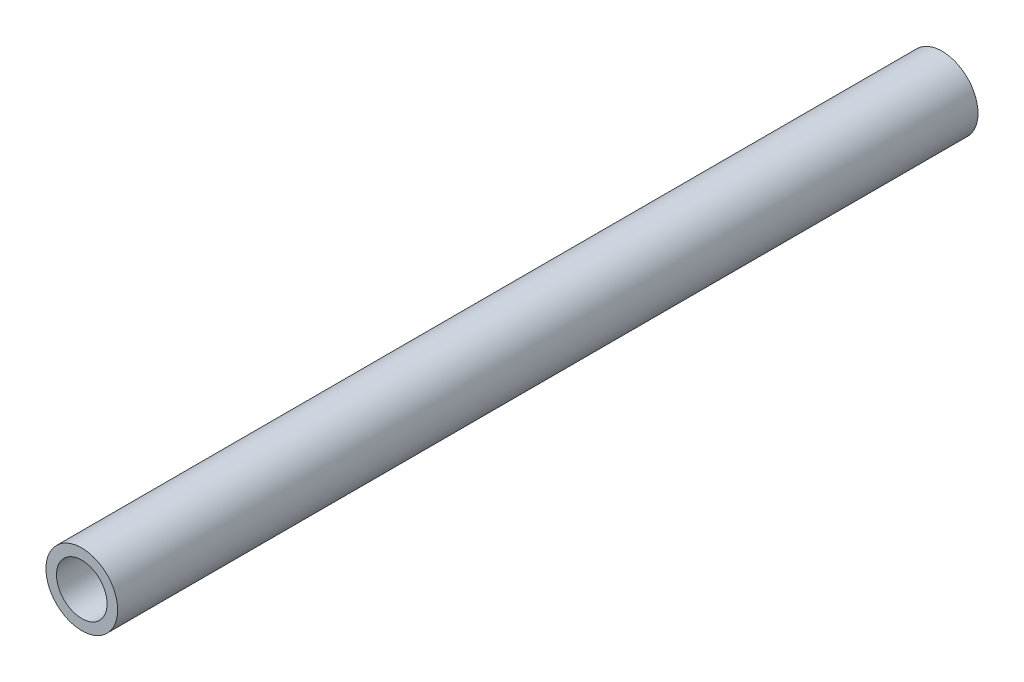
ISO-10303-21;
HEADER;
FILE_DESCRIPTION(('STEP AP214'),'2;1');
FILE_NAME('part.step','',(''),(''),'','','');
FILE_SCHEMA(('AUTOMOTIVE_DESIGN { 1 0 10303 214 1 1 1 1 }'));
ENDSEC;
DATA;
#1=APPLICATION_CONTEXT('core data for automotive mechanical design processes');
#2=APPLICATION_PROTOCOL_DEFINITION('international standard','automotive_design',2000,#1);
#3=PRODUCT_CONTEXT('',#1,'mechanical');
#4=PRODUCT('Part','Part','',(#3));
#5=PRODUCT_RELATED_PRODUCT_CATEGORY('part','',(#4));
#6=PRODUCT_DEFINITION_FORMATION('','',#4);
#7=PRODUCT_DEFINITION_CONTEXT('part definition',#1,'design');
#8=PRODUCT_DEFINITION('design','',#6,#7);
#9=PRODUCT_DEFINITION_SHAPE('','',#8);
#10=(LENGTH_UNIT() NAMED_UNIT(*) SI_UNIT(.MILLI.,.METRE.));
#11=(NAMED_UNIT(*) PLANE_ANGLE_UNIT() SI_UNIT($,.RADIAN.));
#12=(NAMED_UNIT(*) SI_UNIT($,.STERADIAN.) SOLID_ANGLE_UNIT());
#13=UNCERTAINTY_MEASURE_WITH_UNIT(LENGTH_MEASURE(1.E-05),#10,'distance_accuracy_value','');
#14=(GEOMETRIC_REPRESENTATION_CONTEXT(3) GLOBAL_UNCERTAINTY_ASSIGNED_CONTEXT((#13)) GLOBAL_UNIT_ASSIGNED_CONTEXT((#10,
#11,#12)) REPRESENTATION_CONTEXT('',''));
#15=CARTESIAN_POINT('',(0.,0.,0.));
#16=DIRECTION('',(0.,0.,1.));
#17=DIRECTION('',(1.,0.,0.));
#18=AXIS2_PLACEMENT_3D('',#15,#16,#17);
#19=CARTESIAN_POINT('',(0.,0.,152.4));
#20=DIRECTION('',(0.,0.,1.));
#21=DIRECTION('',(1.,0.,0.));
#22=AXIS2_PLACEMENT_3D('',#19,#20,#21);
#23=PLANE('',#22);
#24=CARTESIAN_POINT('',(0.,0.,152.4));
#25=DIRECTION('',(0.,0.,1.));
#26=DIRECTION('',(1.,0.,0.));
#27=AXIS2_PLACEMENT_3D('',#24,#25,#26);
#28=CIRCLE('',#27,6.35);
#29=CARTESIAN_POINT('',(6.35,0.,152.4));
#30=VERTEX_POINT('',#29);
#31=EDGE_CURVE('E10',#30,#30,#28,.T.);
#32=ORIENTED_EDGE('',*,*,#31,.T.);
#33=EDGE_LOOP('',(#32));
#34=FACE_BOUND('',#33,.T.);
#35=CARTESIAN_POINT('',(0.,0.,152.4));
#36=DIRECTION('',(0.,0.,1.));
#37=DIRECTION('',(1.,0.,0.));
#38=AXIS2_PLACEMENT_3D('',#35,#36,#37);
#39=CIRCLE('',#38,4.4831);
#40=CARTESIAN_POINT('',(4.4831,0.,152.4));
#41=VERTEX_POINT('',#40);
#42=EDGE_CURVE('E41',#41,#41,#39,.T.);
#43=ORIENTED_EDGE('',*,*,#42,.F.);
#44=EDGE_LOOP('',(#43));
#45=FACE_BOUND('',#44,.T.);
#46=ADVANCED_FACE('F30',(#34,#45),#23,.T.);
#47=CARTESIAN_POINT('',(0.,0.,0.));
#48=DIRECTION('',(0.,0.,1.));
#49=DIRECTION('',(1.,0.,0.));
#50=AXIS2_PLACEMENT_3D('',#47,#48,#49);
#51=PLANE('',#50);
#52=CARTESIAN_POINT('',(0.,0.,0.));
#53=DIRECTION('',(0.,0.,1.));
#54=DIRECTION('',(1.,0.,0.));
#55=AXIS2_PLACEMENT_3D('',#52,#53,#54);
#56=CIRCLE('',#55,6.35);
#57=CARTESIAN_POINT('',(6.35,0.,0.));
#58=VERTEX_POINT('',#57);
#59=EDGE_CURVE('E34',#58,#58,#56,.T.);
#60=ORIENTED_EDGE('',*,*,#59,.F.);
#61=EDGE_LOOP('',(#60));
#62=FACE_BOUND('',#61,.T.);
#63=CARTESIAN_POINT('',(0.,0.,0.));
#64=DIRECTION('',(0.,0.,1.));
#65=DIRECTION('',(1.,0.,0.));
#66=AXIS2_PLACEMENT_3D('',#63,#64,#65);
#67=CIRCLE('',#66,4.4831);
#68=CARTESIAN_POINT('',(4.4831,0.,0.));
#69=VERTEX_POINT('',#68);
#70=EDGE_CURVE('E43',#69,#69,#67,.T.);
#71=ORIENTED_EDGE('',*,*,#70,.T.);
#72=EDGE_LOOP('',(#71));
#73=FACE_BOUND('',#72,.T.);
#74=ADVANCED_FACE('F53',(#62,#73),#51,.F.);
#75=CARTESIAN_POINT('',(0.,0.,152.4));
#76=DIRECTION('',(0.,0.,-1.));
#77=DIRECTION('',(-1.,0.,0.));
#78=AXIS2_PLACEMENT_3D('',#75,#76,#77);
#79=CYLINDRICAL_SURFACE('',#78,6.35);
#80=ORIENTED_EDGE('',*,*,#31,.F.);
#81=EDGE_LOOP('',(#80));
#82=FACE_BOUND('',#81,.T.);
#83=ORIENTED_EDGE('',*,*,#59,.T.);
#84=EDGE_LOOP('',(#83));
#85=FACE_BOUND('',#84,.T.);
#86=ADVANCED_FACE('F32',(#82,#85),#79,.T.);
#87=CARTESIAN_POINT('',(0.,0.,152.4));
#88=DIRECTION('',(0.,0.,-1.));
#89=DIRECTION('',(-1.,0.,0.));
#90=AXIS2_PLACEMENT_3D('',#87,#88,#89);
#91=CYLINDRICAL_SURFACE('',#90,4.4831);
#92=ORIENTED_EDGE('',*,*,#42,.T.);
#93=EDGE_LOOP('',(#92));
#94=FACE_BOUND('',#93,.T.);
#95=ORIENTED_EDGE('',*,*,#70,.F.);
#96=EDGE_LOOP('',(#95));
#97=FACE_BOUND('',#96,.T.);
#98=ADVANCED_FACE('F49',(#94,#97),#91,.F.);
#99=CLOSED_SHELL('',(#46,#74,#86,#98));
#100=MANIFOLD_SOLID_BREP('B2',#99);
#101=ADVANCED_BREP_SHAPE_REPRESENTATION('',(#18,#100),#14);
#102=SHAPE_DEFINITION_REPRESENTATION(#9,#101);
ENDSEC;
END-ISO-10303-21;
